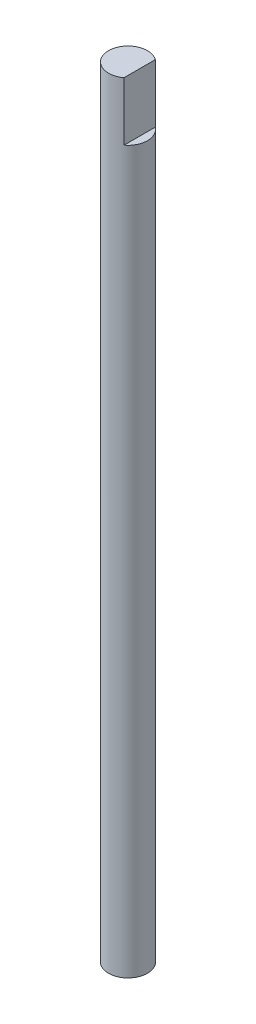
ISO-10303-21;
HEADER;
FILE_DESCRIPTION(('STEP AP214'),'2;1');
FILE_NAME('part.step','',(''),(''),'','','');
FILE_SCHEMA(('AUTOMOTIVE_DESIGN { 1 0 10303 214 1 1 1 1 }'));
ENDSEC;
DATA;
#1=APPLICATION_CONTEXT('core data for automotive mechanical design processes');
#2=APPLICATION_PROTOCOL_DEFINITION('international standard','automotive_design',2000,#1);
#3=PRODUCT_CONTEXT('',#1,'mechanical');
#4=PRODUCT('Part','Part','',(#3));
#5=PRODUCT_RELATED_PRODUCT_CATEGORY('part','',(#4));
#6=PRODUCT_DEFINITION_FORMATION('','',#4);
#7=PRODUCT_DEFINITION_CONTEXT('part definition',#1,'design');
#8=PRODUCT_DEFINITION('design','',#6,#7);
#9=PRODUCT_DEFINITION_SHAPE('','',#8);
#10=(LENGTH_UNIT() NAMED_UNIT(*) SI_UNIT(.MILLI.,.METRE.));
#11=(NAMED_UNIT(*) PLANE_ANGLE_UNIT() SI_UNIT($,.RADIAN.));
#12=(NAMED_UNIT(*) SI_UNIT($,.STERADIAN.) SOLID_ANGLE_UNIT());
#13=UNCERTAINTY_MEASURE_WITH_UNIT(LENGTH_MEASURE(1.E-05),#10,'distance_accuracy_value','');
#14=(GEOMETRIC_REPRESENTATION_CONTEXT(3) GLOBAL_UNCERTAINTY_ASSIGNED_CONTEXT((#13)) GLOBAL_UNIT_ASSIGNED_CONTEXT((#10,
#11,#12)) REPRESENTATION_CONTEXT('',''));
#15=CARTESIAN_POINT('',(0.,0.,0.));
#16=DIRECTION('',(0.,0.,1.));
#17=DIRECTION('',(1.,0.,0.));
#18=AXIS2_PLACEMENT_3D('',#15,#16,#17);
#19=CARTESIAN_POINT('',(0.,200.,0.));
#20=DIRECTION('',(0.,-1.,0.));
#21=DIRECTION('',(0.,0.,-1.));
#22=AXIS2_PLACEMENT_3D('',#19,#20,#21);
#23=CYLINDRICAL_SURFACE('',#22,5.);
#24=CARTESIAN_POINT('',(0.,200.,0.));
#25=DIRECTION('',(0.,1.,0.));
#26=DIRECTION('',(0.,0.,1.));
#27=AXIS2_PLACEMENT_3D('',#24,#25,#26);
#28=CIRCLE('',#27,5.);
#29=CARTESIAN_POINT('',(3.,200.,-4.));
#30=VERTEX_POINT('',#29);
#31=CARTESIAN_POINT('',(3.,200.,4.));
#32=VERTEX_POINT('',#31);
#33=EDGE_CURVE('E69',#30,#32,#28,.T.);
#34=ORIENTED_EDGE('',*,*,#33,.F.);
#35=DIRECTION('',(0.,-1.,0.));
#36=VECTOR('',#35,1.);
#37=CARTESIAN_POINT('',(3.,200.,-4.));
#38=LINE('',#37,#36);
#39=CARTESIAN_POINT('',(3.,185.,-4.));
#40=VERTEX_POINT('',#39);
#41=EDGE_CURVE('E49',#30,#40,#38,.T.);
#42=ORIENTED_EDGE('',*,*,#41,.T.);
#43=CARTESIAN_POINT('',(0.,185.,0.));
#44=DIRECTION('',(0.,-1.,0.));
#45=DIRECTION('',(0.,0.,-1.));
#46=AXIS2_PLACEMENT_3D('',#43,#44,#45);
#47=CIRCLE('',#46,5.);
#48=CARTESIAN_POINT('',(3.,185.,4.));
#49=VERTEX_POINT('',#48);
#50=EDGE_CURVE('E11',#40,#49,#47,.T.);
#51=ORIENTED_EDGE('',*,*,#50,.T.);
#52=DIRECTION('',(0.,-1.,0.));
#53=VECTOR('',#52,1.);
#54=CARTESIAN_POINT('',(3.,200.,4.));
#55=LINE('',#54,#53);
#56=EDGE_CURVE('E64',#49,#32,#55,.F.);
#57=ORIENTED_EDGE('',*,*,#56,.T.);
#58=EDGE_LOOP('',(#34,#42,#51,#57));
#59=FACE_BOUND('',#58,.T.);
#60=CARTESIAN_POINT('',(0.,0.,0.));
#61=DIRECTION('',(0.,1.,0.));
#62=DIRECTION('',(0.,0.,1.));
#63=AXIS2_PLACEMENT_3D('',#60,#61,#62);
#64=CIRCLE('',#63,5.);
#65=CARTESIAN_POINT('',(0.,0.,5.));
#66=VERTEX_POINT('',#65);
#67=EDGE_CURVE('E70',#66,#66,#64,.T.);
#68=ORIENTED_EDGE('',*,*,#67,.T.);
#69=EDGE_LOOP('',(#68));
#70=FACE_BOUND('',#69,.T.);
#71=ADVANCED_FACE('F35',(#59,#70),#23,.T.);
#72=CARTESIAN_POINT('',(0.,200.,0.));
#73=DIRECTION('',(0.,1.,0.));
#74=DIRECTION('',(0.,0.,1.));
#75=AXIS2_PLACEMENT_3D('',#72,#73,#74);
#76=PLANE('',#75);
#77=DIRECTION('',(0.,0.,1.));
#78=VECTOR('',#77,1.);
#79=CARTESIAN_POINT('',(3.,200.,0.));
#80=LINE('',#79,#78);
#81=EDGE_CURVE('E42',#30,#32,#80,.T.);
#82=ORIENTED_EDGE('',*,*,#81,.F.);
#83=ORIENTED_EDGE('',*,*,#33,.T.);
#84=EDGE_LOOP('',(#82,#83));
#85=FACE_BOUND('',#84,.T.);
#86=ADVANCED_FACE('F77',(#85),#76,.T.);
#87=CARTESIAN_POINT('',(0.,0.,0.));
#88=DIRECTION('',(0.,1.,0.));
#89=DIRECTION('',(0.,0.,1.));
#90=AXIS2_PLACEMENT_3D('',#87,#88,#89);
#91=PLANE('',#90);
#92=ORIENTED_EDGE('',*,*,#67,.F.);
#93=EDGE_LOOP('',(#92));
#94=FACE_BOUND('',#93,.T.);
#95=ADVANCED_FACE('F79',(#94),#91,.F.);
#96=CARTESIAN_POINT('',(3.,185.,-5.));
#97=DIRECTION('',(0.,-1.,0.));
#98=DIRECTION('',(0.,0.,-1.));
#99=AXIS2_PLACEMENT_3D('',#96,#97,#98);
#100=PLANE('',#99);
#101=DIRECTION('',(0.,0.,1.));
#102=VECTOR('',#101,1.);
#103=CARTESIAN_POINT('',(3.,185.,-5.));
#104=LINE('',#103,#102);
#105=EDGE_CURVE('E61',#40,#49,#104,.T.);
#106=ORIENTED_EDGE('',*,*,#105,.T.);
#107=ORIENTED_EDGE('',*,*,#50,.F.);
#108=EDGE_LOOP('',(#106,#107));
#109=FACE_BOUND('',#108,.T.);
#110=ADVANCED_FACE('F60',(#109),#100,.F.);
#111=CARTESIAN_POINT('',(3.,201.134958609329,-5.));
#112=DIRECTION('',(-1.,0.,0.));
#113=DIRECTION('',(0.,-1.,0.));
#114=AXIS2_PLACEMENT_3D('',#111,#112,#113);
#115=PLANE('',#114);
#116=ORIENTED_EDGE('',*,*,#81,.T.);
#117=ORIENTED_EDGE('',*,*,#56,.F.);
#118=ORIENTED_EDGE('',*,*,#105,.F.);
#119=ORIENTED_EDGE('',*,*,#41,.F.);
#120=EDGE_LOOP('',(#116,#117,#118,#119));
#121=FACE_BOUND('',#120,.T.);
#122=ADVANCED_FACE('F63',(#121),#115,.F.);
#123=CLOSED_SHELL('',(#71,#86,#95,#110,#122));
#124=MANIFOLD_SOLID_BREP('B2',#123);
#125=ADVANCED_BREP_SHAPE_REPRESENTATION('',(#18,#124),#14);
#126=SHAPE_DEFINITION_REPRESENTATION(#9,#125);
ENDSEC;
END-ISO-10303-21;
